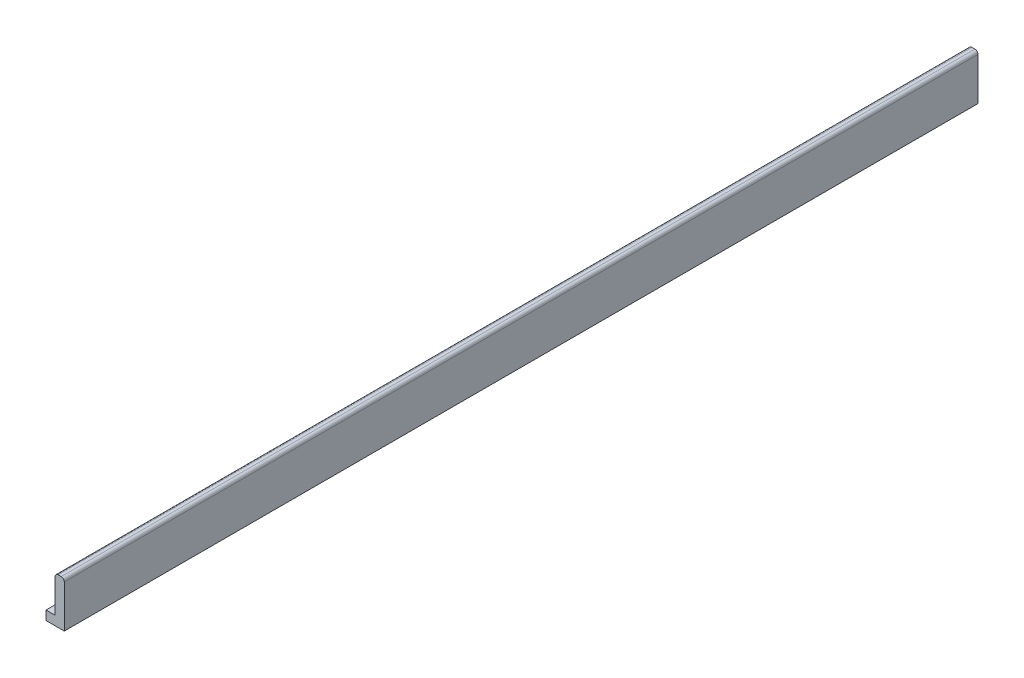
ISO-10303-21;
HEADER;
FILE_DESCRIPTION(('STEP AP214'),'2;1');
FILE_NAME('part.step','',(''),(''),'','','');
FILE_SCHEMA(('AUTOMOTIVE_DESIGN { 1 0 10303 214 1 1 1 1 }'));
ENDSEC;
DATA;
#1=APPLICATION_CONTEXT('core data for automotive mechanical design processes');
#2=APPLICATION_PROTOCOL_DEFINITION('international standard','automotive_design',2000,#1);
#3=PRODUCT_CONTEXT('',#1,'mechanical');
#4=PRODUCT('Part','Part','',(#3));
#5=PRODUCT_RELATED_PRODUCT_CATEGORY('part','',(#4));
#6=PRODUCT_DEFINITION_FORMATION('','',#4);
#7=PRODUCT_DEFINITION_CONTEXT('part definition',#1,'design');
#8=PRODUCT_DEFINITION('design','',#6,#7);
#9=PRODUCT_DEFINITION_SHAPE('','',#8);
#10=(LENGTH_UNIT() NAMED_UNIT(*) SI_UNIT(.MILLI.,.METRE.));
#11=(NAMED_UNIT(*) PLANE_ANGLE_UNIT() SI_UNIT($,.RADIAN.));
#12=(NAMED_UNIT(*) SI_UNIT($,.STERADIAN.) SOLID_ANGLE_UNIT());
#13=UNCERTAINTY_MEASURE_WITH_UNIT(LENGTH_MEASURE(1.E-05),#10,'distance_accuracy_value','');
#14=(GEOMETRIC_REPRESENTATION_CONTEXT(3) GLOBAL_UNCERTAINTY_ASSIGNED_CONTEXT((#13)) GLOBAL_UNIT_ASSIGNED_CONTEXT((#10,
#11,#12)) REPRESENTATION_CONTEXT('',''));
#15=CARTESIAN_POINT('',(0.,0.,0.));
#16=DIRECTION('',(0.,0.,1.));
#17=DIRECTION('',(1.,0.,0.));
#18=AXIS2_PLACEMENT_3D('',#15,#16,#17);
#19=CARTESIAN_POINT('',(-60.,-75.,3000.));
#20=DIRECTION('',(0.,1.,0.));
#21=DIRECTION('',(0.,0.,1.));
#22=AXIS2_PLACEMENT_3D('',#19,#20,#21);
#23=PLANE('',#22);
#24=DIRECTION('',(1.,0.,0.));
#25=VECTOR('',#24,1.);
#26=CARTESIAN_POINT('',(-60.,-75.,0.));
#27=LINE('',#26,#25);
#28=CARTESIAN_POINT('',(-60.,-75.,0.));
#29=VERTEX_POINT('',#28);
#30=CARTESIAN_POINT('',(0.,-75.,0.));
#31=VERTEX_POINT('',#30);
#32=EDGE_CURVE('E121',#29,#31,#27,.T.);
#33=ORIENTED_EDGE('',*,*,#32,.T.);
#34=DIRECTION('',(0.,0.,-1.));
#35=VECTOR('',#34,1.);
#36=CARTESIAN_POINT('',(0.,-75.,3000.));
#37=LINE('',#36,#35);
#38=CARTESIAN_POINT('',(0.,-75.,3000.));
#39=VERTEX_POINT('',#38);
#40=EDGE_CURVE('E104',#39,#31,#37,.T.);
#41=ORIENTED_EDGE('',*,*,#40,.F.);
#42=DIRECTION('',(1.,0.,0.));
#43=VECTOR('',#42,1.);
#44=CARTESIAN_POINT('',(-60.,-75.,3000.));
#45=LINE('',#44,#43);
#46=CARTESIAN_POINT('',(-60.,-75.,3000.));
#47=VERTEX_POINT('',#46);
#48=EDGE_CURVE('E109',#47,#39,#45,.T.);
#49=ORIENTED_EDGE('',*,*,#48,.F.);
#50=DIRECTION('',(0.,0.,-1.));
#51=VECTOR('',#50,1.);
#52=CARTESIAN_POINT('',(-60.,-75.,3000.));
#53=LINE('',#52,#51);
#54=EDGE_CURVE('E171',#47,#29,#53,.T.);
#55=ORIENTED_EDGE('',*,*,#54,.T.);
#56=EDGE_LOOP('',(#33,#41,#49,#55));
#57=FACE_BOUND('',#56,.T.);
#58=ADVANCED_FACE('F36',(#57),#23,.F.);
#59=CARTESIAN_POINT('',(0.,-75.,3000.));
#60=DIRECTION('',(-1.,0.,0.));
#61=DIRECTION('',(0.,-1.,0.));
#62=AXIS2_PLACEMENT_3D('',#59,#60,#61);
#63=PLANE('',#62);
#64=DIRECTION('',(0.,1.,0.));
#65=VECTOR('',#64,1.);
#66=CARTESIAN_POINT('',(0.,-75.,0.));
#67=LINE('',#66,#65);
#68=CARTESIAN_POINT('',(0.,65.,0.));
#69=VERTEX_POINT('',#68);
#70=EDGE_CURVE('E162',#31,#69,#67,.T.);
#71=ORIENTED_EDGE('',*,*,#70,.T.);
#72=DIRECTION('',(0.,0.,-1.));
#73=VECTOR('',#72,1.);
#74=CARTESIAN_POINT('',(0.,65.,3000.));
#75=LINE('',#74,#73);
#76=CARTESIAN_POINT('',(0.,65.,3000.));
#77=VERTEX_POINT('',#76);
#78=EDGE_CURVE('E11',#69,#77,#75,.F.);
#79=ORIENTED_EDGE('',*,*,#78,.T.);
#80=DIRECTION('',(0.,1.,0.));
#81=VECTOR('',#80,1.);
#82=CARTESIAN_POINT('',(0.,-75.,3000.));
#83=LINE('',#82,#81);
#84=EDGE_CURVE('E100',#39,#77,#83,.T.);
#85=ORIENTED_EDGE('',*,*,#84,.F.);
#86=ORIENTED_EDGE('',*,*,#40,.T.);
#87=EDGE_LOOP('',(#71,#79,#85,#86));
#88=FACE_BOUND('',#87,.T.);
#89=ADVANCED_FACE('F102',(#88),#63,.F.);
#90=CARTESIAN_POINT('',(0.,75.,3000.));
#91=DIRECTION('',(0.,-1.,0.));
#92=DIRECTION('',(0.,0.,-1.));
#93=AXIS2_PLACEMENT_3D('',#90,#91,#92);
#94=PLANE('',#93);
#95=DIRECTION('',(-1.,0.,0.));
#96=VECTOR('',#95,1.);
#97=CARTESIAN_POINT('',(0.,75.,0.));
#98=LINE('',#97,#96);
#99=CARTESIAN_POINT('',(-10.,75.,0.));
#100=VERTEX_POINT('',#99);
#101=CARTESIAN_POINT('',(-20.,75.,0.));
#102=VERTEX_POINT('',#101);
#103=EDGE_CURVE('E157',#100,#102,#98,.T.);
#104=ORIENTED_EDGE('',*,*,#103,.T.);
#105=DIRECTION('',(0.,0.,-1.));
#106=VECTOR('',#105,1.);
#107=CARTESIAN_POINT('',(-20.,75.,3000.));
#108=LINE('',#107,#106);
#109=CARTESIAN_POINT('',(-20.,75.,3000.));
#110=VERTEX_POINT('',#109);
#111=EDGE_CURVE('E57',#102,#110,#108,.F.);
#112=ORIENTED_EDGE('',*,*,#111,.T.);
#113=DIRECTION('',(-1.,0.,0.));
#114=VECTOR('',#113,1.);
#115=CARTESIAN_POINT('',(0.,75.,3000.));
#116=LINE('',#115,#114);
#117=CARTESIAN_POINT('',(-10.,75.,3000.));
#118=VERTEX_POINT('',#117);
#119=EDGE_CURVE('E108',#118,#110,#116,.T.);
#120=ORIENTED_EDGE('',*,*,#119,.F.);
#121=DIRECTION('',(0.,0.,-1.));
#122=VECTOR('',#121,1.);
#123=CARTESIAN_POINT('',(-10.,75.,3000.));
#124=LINE('',#123,#122);
#125=EDGE_CURVE('E136',#118,#100,#124,.T.);
#126=ORIENTED_EDGE('',*,*,#125,.T.);
#127=EDGE_LOOP('',(#104,#112,#120,#126));
#128=FACE_BOUND('',#127,.T.);
#129=ADVANCED_FACE('F160',(#128),#94,.F.);
#130=CARTESIAN_POINT('',(-30.,75.,3000.));
#131=DIRECTION('',(1.,0.,0.));
#132=DIRECTION('',(0.,0.,-1.));
#133=AXIS2_PLACEMENT_3D('',#130,#131,#132);
#134=PLANE('',#133);
#135=DIRECTION('',(0.,-1.,0.));
#136=VECTOR('',#135,1.);
#137=CARTESIAN_POINT('',(-30.,75.,3000.));
#138=LINE('',#137,#136);
#139=CARTESIAN_POINT('',(-30.,65.,3000.));
#140=VERTEX_POINT('',#139);
#141=CARTESIAN_POINT('',(-30.,-45.,3000.));
#142=VERTEX_POINT('',#141);
#143=EDGE_CURVE('E143',#140,#142,#138,.T.);
#144=ORIENTED_EDGE('',*,*,#143,.F.);
#145=DIRECTION('',(0.,0.,-1.));
#146=VECTOR('',#145,1.);
#147=CARTESIAN_POINT('',(-30.,65.,3000.));
#148=LINE('',#147,#146);
#149=CARTESIAN_POINT('',(-30.,65.,0.));
#150=VERTEX_POINT('',#149);
#151=EDGE_CURVE('E122',#140,#150,#148,.T.);
#152=ORIENTED_EDGE('',*,*,#151,.T.);
#153=DIRECTION('',(0.,-1.,0.));
#154=VECTOR('',#153,1.);
#155=CARTESIAN_POINT('',(-30.,75.,0.));
#156=LINE('',#155,#154);
#157=CARTESIAN_POINT('',(-30.,-45.,0.));
#158=VERTEX_POINT('',#157);
#159=EDGE_CURVE('E159',#150,#158,#156,.T.);
#160=ORIENTED_EDGE('',*,*,#159,.T.);
#161=DIRECTION('',(0.,0.,-1.));
#162=VECTOR('',#161,1.);
#163=CARTESIAN_POINT('',(-30.,-45.,3000.));
#164=LINE('',#163,#162);
#165=EDGE_CURVE('E123',#142,#158,#164,.T.);
#166=ORIENTED_EDGE('',*,*,#165,.F.);
#167=EDGE_LOOP('',(#144,#152,#160,#166));
#168=FACE_BOUND('',#167,.T.);
#169=ADVANCED_FACE('F148',(#168),#134,.F.);
#170=CARTESIAN_POINT('',(-30.,-45.,3000.));
#171=DIRECTION('',(0.,-1.,0.));
#172=DIRECTION('',(0.,0.,-1.));
#173=AXIS2_PLACEMENT_3D('',#170,#171,#172);
#174=PLANE('',#173);
#175=DIRECTION('',(-1.,0.,0.));
#176=VECTOR('',#175,1.);
#177=CARTESIAN_POINT('',(-30.,-45.,0.));
#178=LINE('',#177,#176);
#179=CARTESIAN_POINT('',(-60.,-45.,0.));
#180=VERTEX_POINT('',#179);
#181=EDGE_CURVE('E164',#158,#180,#178,.T.);
#182=ORIENTED_EDGE('',*,*,#181,.T.);
#183=DIRECTION('',(0.,0.,-1.));
#184=VECTOR('',#183,1.);
#185=CARTESIAN_POINT('',(-60.,-45.,3000.));
#186=LINE('',#185,#184);
#187=CARTESIAN_POINT('',(-60.,-45.,3000.));
#188=VERTEX_POINT('',#187);
#189=EDGE_CURVE('E129',#188,#180,#186,.T.);
#190=ORIENTED_EDGE('',*,*,#189,.F.);
#191=DIRECTION('',(-1.,0.,0.));
#192=VECTOR('',#191,1.);
#193=CARTESIAN_POINT('',(-30.,-45.,3000.));
#194=LINE('',#193,#192);
#195=EDGE_CURVE('E151',#142,#188,#194,.T.);
#196=ORIENTED_EDGE('',*,*,#195,.F.);
#197=ORIENTED_EDGE('',*,*,#165,.T.);
#198=EDGE_LOOP('',(#182,#190,#196,#197));
#199=FACE_BOUND('',#198,.T.);
#200=ADVANCED_FACE('F181',(#199),#174,.F.);
#201=CARTESIAN_POINT('',(-60.,-45.,3000.));
#202=DIRECTION('',(1.,0.,0.));
#203=DIRECTION('',(0.,0.,-1.));
#204=AXIS2_PLACEMENT_3D('',#201,#202,#203);
#205=PLANE('',#204);
#206=DIRECTION('',(0.,-1.,0.));
#207=VECTOR('',#206,1.);
#208=CARTESIAN_POINT('',(-60.,-45.,0.));
#209=LINE('',#208,#207);
#210=EDGE_CURVE('E118',#180,#29,#209,.T.);
#211=ORIENTED_EDGE('',*,*,#210,.T.);
#212=ORIENTED_EDGE('',*,*,#54,.F.);
#213=DIRECTION('',(0.,-1.,0.));
#214=VECTOR('',#213,1.);
#215=CARTESIAN_POINT('',(-60.,-45.,3000.));
#216=LINE('',#215,#214);
#217=EDGE_CURVE('E114',#188,#47,#216,.T.);
#218=ORIENTED_EDGE('',*,*,#217,.F.);
#219=ORIENTED_EDGE('',*,*,#189,.T.);
#220=EDGE_LOOP('',(#211,#212,#218,#219));
#221=FACE_BOUND('',#220,.T.);
#222=ADVANCED_FACE('F176',(#221),#205,.F.);
#223=CARTESIAN_POINT('',(0.,0.,3000.));
#224=DIRECTION('',(0.,0.,1.));
#225=DIRECTION('',(1.,0.,0.));
#226=AXIS2_PLACEMENT_3D('',#223,#224,#225);
#227=PLANE('',#226);
#228=ORIENTED_EDGE('',*,*,#119,.T.);
#229=CARTESIAN_POINT('',(-20.,65.,3000.));
#230=DIRECTION('',(0.,0.,1.));
#231=DIRECTION('',(1.,0.,0.));
#232=AXIS2_PLACEMENT_3D('',#229,#230,#231);
#233=CIRCLE('',#232,10.);
#234=EDGE_CURVE('E44',#110,#140,#233,.T.);
#235=ORIENTED_EDGE('',*,*,#234,.T.);
#236=ORIENTED_EDGE('',*,*,#143,.T.);
#237=ORIENTED_EDGE('',*,*,#195,.T.);
#238=ORIENTED_EDGE('',*,*,#217,.T.);
#239=ORIENTED_EDGE('',*,*,#48,.T.);
#240=ORIENTED_EDGE('',*,*,#84,.T.);
#241=CARTESIAN_POINT('',(-10.,65.,3000.));
#242=DIRECTION('',(0.,0.,1.));
#243=DIRECTION('',(1.,0.,0.));
#244=AXIS2_PLACEMENT_3D('',#241,#242,#243);
#245=CIRCLE('',#244,10.);
#246=EDGE_CURVE('E140',#77,#118,#245,.T.);
#247=ORIENTED_EDGE('',*,*,#246,.T.);
#248=EDGE_LOOP('',(#228,#235,#236,#237,#238,#239,#240,#247));
#249=FACE_BOUND('',#248,.T.);
#250=ADVANCED_FACE('F112',(#249),#227,.T.);
#251=CARTESIAN_POINT('',(0.,0.,0.));
#252=DIRECTION('',(0.,0.,1.));
#253=DIRECTION('',(1.,0.,0.));
#254=AXIS2_PLACEMENT_3D('',#251,#252,#253);
#255=PLANE('',#254);
#256=ORIENTED_EDGE('',*,*,#159,.F.);
#257=CARTESIAN_POINT('',(-20.,65.,0.));
#258=DIRECTION('',(0.,0.,1.));
#259=DIRECTION('',(1.,0.,0.));
#260=AXIS2_PLACEMENT_3D('',#257,#258,#259);
#261=CIRCLE('',#260,10.);
#262=EDGE_CURVE('E134',#150,#102,#261,.F.);
#263=ORIENTED_EDGE('',*,*,#262,.T.);
#264=ORIENTED_EDGE('',*,*,#103,.F.);
#265=CARTESIAN_POINT('',(-10.,65.,0.));
#266=DIRECTION('',(0.,0.,1.));
#267=DIRECTION('',(1.,0.,0.));
#268=AXIS2_PLACEMENT_3D('',#265,#266,#267);
#269=CIRCLE('',#268,10.);
#270=EDGE_CURVE('E126',#100,#69,#269,.F.);
#271=ORIENTED_EDGE('',*,*,#270,.T.);
#272=ORIENTED_EDGE('',*,*,#70,.F.);
#273=ORIENTED_EDGE('',*,*,#32,.F.);
#274=ORIENTED_EDGE('',*,*,#210,.F.);
#275=ORIENTED_EDGE('',*,*,#181,.F.);
#276=EDGE_LOOP('',(#256,#263,#264,#271,#272,#273,#274,#275));
#277=FACE_BOUND('',#276,.T.);
#278=ADVANCED_FACE('F156',(#277),#255,.F.);
#279=CARTESIAN_POINT('',(-20.,65.,3000.));
#280=DIRECTION('',(0.,0.,-1.));
#281=DIRECTION('',(-1.,0.,0.));
#282=AXIS2_PLACEMENT_3D('',#279,#280,#281);
#283=CYLINDRICAL_SURFACE('',#282,10.);
#284=ORIENTED_EDGE('',*,*,#234,.F.);
#285=ORIENTED_EDGE('',*,*,#111,.F.);
#286=ORIENTED_EDGE('',*,*,#262,.F.);
#287=ORIENTED_EDGE('',*,*,#151,.F.);
#288=EDGE_LOOP('',(#284,#285,#286,#287));
#289=FACE_BOUND('',#288,.T.);
#290=ADVANCED_FACE('F153',(#289),#283,.T.);
#291=CARTESIAN_POINT('',(-10.,65.,3000.));
#292=DIRECTION('',(0.,0.,-1.));
#293=DIRECTION('',(-1.,0.,0.));
#294=AXIS2_PLACEMENT_3D('',#291,#292,#293);
#295=CYLINDRICAL_SURFACE('',#294,10.);
#296=ORIENTED_EDGE('',*,*,#246,.F.);
#297=ORIENTED_EDGE('',*,*,#78,.F.);
#298=ORIENTED_EDGE('',*,*,#270,.F.);
#299=ORIENTED_EDGE('',*,*,#125,.F.);
#300=EDGE_LOOP('',(#296,#297,#298,#299));
#301=FACE_BOUND('',#300,.T.);
#302=ADVANCED_FACE('F38',(#301),#295,.T.);
#303=CLOSED_SHELL('',(#58,#89,#129,#169,#200,#222,#250,#278,#290,#302));
#304=MANIFOLD_SOLID_BREP('B2',#303);
#305=ADVANCED_BREP_SHAPE_REPRESENTATION('',(#18,#304),#14);
#306=SHAPE_DEFINITION_REPRESENTATION(#9,#305);
ENDSEC;
END-ISO-10303-21;
